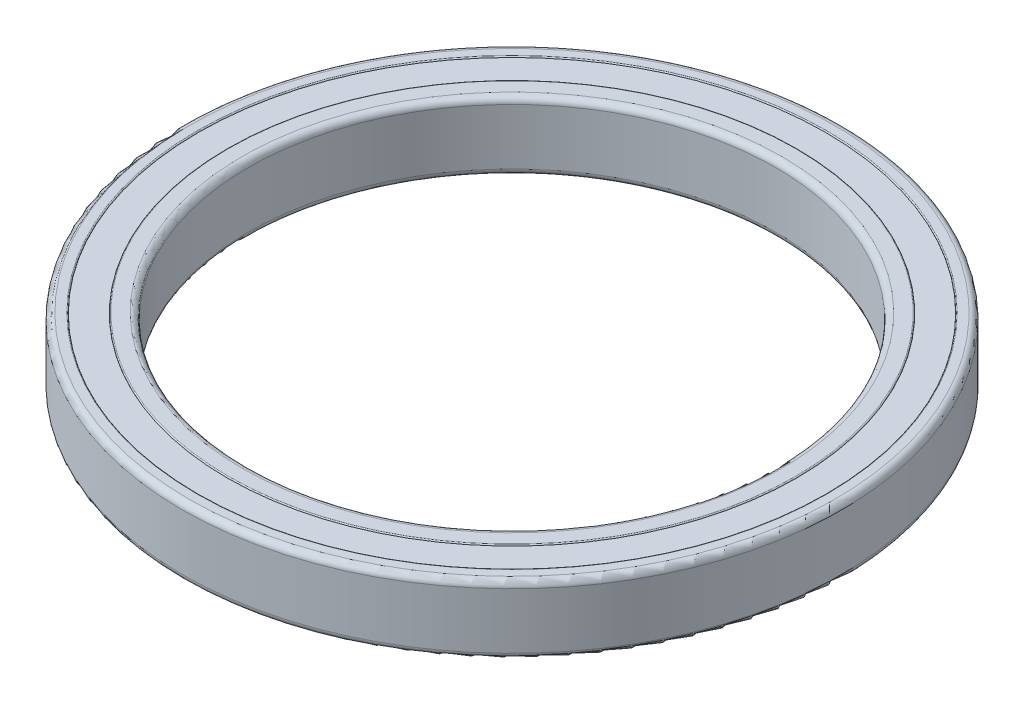
ISO-10303-21;
HEADER;
FILE_DESCRIPTION(('STEP AP214'),'2;1');
FILE_NAME('part.step','',(''),(''),'','','');
FILE_SCHEMA(('AUTOMOTIVE_DESIGN { 1 0 10303 214 1 1 1 1 }'));
ENDSEC;
DATA;
#1=APPLICATION_CONTEXT('core data for automotive mechanical design processes');
#2=APPLICATION_PROTOCOL_DEFINITION('international standard','automotive_design',2000,#1);
#3=PRODUCT_CONTEXT('',#1,'mechanical');
#4=PRODUCT('Part','Part','',(#3));
#5=PRODUCT_RELATED_PRODUCT_CATEGORY('part','',(#4));
#6=PRODUCT_DEFINITION_FORMATION('','',#4);
#7=PRODUCT_DEFINITION_CONTEXT('part definition',#1,'design');
#8=PRODUCT_DEFINITION('design','',#6,#7);
#9=PRODUCT_DEFINITION_SHAPE('','',#8);
#10=(LENGTH_UNIT() NAMED_UNIT(*) SI_UNIT(.MILLI.,.METRE.));
#11=(NAMED_UNIT(*) PLANE_ANGLE_UNIT() SI_UNIT($,.RADIAN.));
#12=(NAMED_UNIT(*) SI_UNIT($,.STERADIAN.) SOLID_ANGLE_UNIT());
#13=UNCERTAINTY_MEASURE_WITH_UNIT(LENGTH_MEASURE(1.E-05),#10,'distance_accuracy_value','');
#14=(GEOMETRIC_REPRESENTATION_CONTEXT(3) GLOBAL_UNCERTAINTY_ASSIGNED_CONTEXT((#13)) GLOBAL_UNIT_ASSIGNED_CONTEXT((#10,
#11,#12)) REPRESENTATION_CONTEXT('',''));
#15=CARTESIAN_POINT('',(0.,0.,0.));
#16=DIRECTION('',(0.,0.,1.));
#17=DIRECTION('',(1.,0.,0.));
#18=AXIS2_PLACEMENT_3D('',#15,#16,#17);
#19=CARTESIAN_POINT('',(0.,6.3,0.));
#20=DIRECTION('',(0.,1.,0.));
#21=DIRECTION('',(0.,0.,1.));
#22=AXIS2_PLACEMENT_3D('',#19,#20,#21);
#23=PLANE('',#22);
#24=CARTESIAN_POINT('',(0.,6.3,0.));
#25=DIRECTION('',(0.,1.,0.));
#26=DIRECTION('',(0.,0.,1.));
#27=AXIS2_PLACEMENT_3D('',#24,#25,#26);
#28=CIRCLE('',#27,59.5);
#29=CARTESIAN_POINT('',(0.,6.3,59.5));
#30=VERTEX_POINT('',#29);
#31=EDGE_CURVE('E11',#30,#30,#28,.T.);
#32=ORIENTED_EDGE('',*,*,#31,.T.);
#33=EDGE_LOOP('',(#32));
#34=FACE_BOUND('',#33,.T.);
#35=CARTESIAN_POINT('',(0.,6.3,0.));
#36=DIRECTION('',(0.,1.,0.));
#37=DIRECTION('',(0.,0.,1.));
#38=AXIS2_PLACEMENT_3D('',#35,#36,#37);
#39=CIRCLE('',#38,54.);
#40=CARTESIAN_POINT('',(0.,6.3,54.));
#41=VERTEX_POINT('',#40);
#42=EDGE_CURVE('E54',#41,#41,#39,.T.);
#43=ORIENTED_EDGE('',*,*,#42,.F.);
#44=EDGE_LOOP('',(#43));
#45=FACE_BOUND('',#44,.T.);
#46=ADVANCED_FACE('F43',(#34,#45),#23,.T.);
#47=CARTESIAN_POINT('',(0.,-6.3,0.));
#48=DIRECTION('',(0.,1.,0.));
#49=DIRECTION('',(0.,0.,1.));
#50=AXIS2_PLACEMENT_3D('',#47,#48,#49);
#51=PLANE('',#50);
#52=CARTESIAN_POINT('',(0.,-6.3,0.));
#53=DIRECTION('',(0.,1.,0.));
#54=DIRECTION('',(0.,0.,1.));
#55=AXIS2_PLACEMENT_3D('',#52,#53,#54);
#56=CIRCLE('',#55,59.5);
#57=CARTESIAN_POINT('',(0.,-6.3,59.5));
#58=VERTEX_POINT('',#57);
#59=EDGE_CURVE('E47',#58,#58,#56,.T.);
#60=ORIENTED_EDGE('',*,*,#59,.F.);
#61=EDGE_LOOP('',(#60));
#62=FACE_BOUND('',#61,.T.);
#63=CARTESIAN_POINT('',(0.,-6.3,0.));
#64=DIRECTION('',(0.,1.,0.));
#65=DIRECTION('',(0.,0.,1.));
#66=AXIS2_PLACEMENT_3D('',#63,#64,#65);
#67=CIRCLE('',#66,54.);
#68=CARTESIAN_POINT('',(0.,-6.3,54.));
#69=VERTEX_POINT('',#68);
#70=EDGE_CURVE('E56',#69,#69,#67,.T.);
#71=ORIENTED_EDGE('',*,*,#70,.T.);
#72=EDGE_LOOP('',(#71));
#73=FACE_BOUND('',#72,.T.);
#74=ADVANCED_FACE('F66',(#62,#73),#51,.F.);
#75=CARTESIAN_POINT('',(0.,6.3,0.));
#76=DIRECTION('',(0.,-1.,0.));
#77=DIRECTION('',(0.,0.,-1.));
#78=AXIS2_PLACEMENT_3D('',#75,#76,#77);
#79=CYLINDRICAL_SURFACE('',#78,59.5);
#80=ORIENTED_EDGE('',*,*,#31,.F.);
#81=EDGE_LOOP('',(#80));
#82=FACE_BOUND('',#81,.T.);
#83=ORIENTED_EDGE('',*,*,#59,.T.);
#84=EDGE_LOOP('',(#83));
#85=FACE_BOUND('',#84,.T.);
#86=ADVANCED_FACE('F45',(#82,#85),#79,.T.);
#87=CARTESIAN_POINT('',(0.,6.3,0.));
#88=DIRECTION('',(0.,-1.,0.));
#89=DIRECTION('',(0.,0.,-1.));
#90=AXIS2_PLACEMENT_3D('',#87,#88,#89);
#91=CYLINDRICAL_SURFACE('',#90,54.);
#92=ORIENTED_EDGE('',*,*,#42,.T.);
#93=EDGE_LOOP('',(#92));
#94=FACE_BOUND('',#93,.T.);
#95=ORIENTED_EDGE('',*,*,#70,.F.);
#96=EDGE_LOOP('',(#95));
#97=FACE_BOUND('',#96,.T.);
#98=ADVANCED_FACE('F62',(#94,#97),#91,.F.);
#99=CLOSED_SHELL('',(#46,#74,#86,#98));
#100=MANIFOLD_SOLID_BREP('B2',#99);
#101=CARTESIAN_POINT('',(0.,6.5,0.));
#102=DIRECTION('',(0.,1.,0.));
#103=DIRECTION('',(0.,0.,1.));
#104=AXIS2_PLACEMENT_3D('',#101,#102,#103);
#105=PLANE('',#104);
#106=CARTESIAN_POINT('',(0.,6.5,0.));
#107=DIRECTION('',(0.,1.,0.));
#108=DIRECTION('',(0.,0.,1.));
#109=AXIS2_PLACEMENT_3D('',#106,#107,#108);
#110=CIRCLE('',#109,53.8);
#111=CARTESIAN_POINT('',(0.,6.5,53.8));
#112=VERTEX_POINT('',#111);
#113=EDGE_CURVE('E42',#112,#112,#110,.T.);
#114=ORIENTED_EDGE('',*,*,#113,.T.);
#115=EDGE_LOOP('',(#114));
#116=FACE_BOUND('',#115,.T.);
#117=CARTESIAN_POINT('',(0.,6.5,0.));
#118=DIRECTION('',(0.,1.,0.));
#119=DIRECTION('',(0.,0.,1.));
#120=AXIS2_PLACEMENT_3D('',#117,#118,#119);
#121=CIRCLE('',#120,51.2);
#122=CARTESIAN_POINT('',(0.,6.5,51.2));
#123=VERTEX_POINT('',#122);
#124=EDGE_CURVE('E131',#123,#123,#121,.F.);
#125=ORIENTED_EDGE('',*,*,#124,.T.);
#126=EDGE_LOOP('',(#125));
#127=FACE_BOUND('',#126,.T.);
#128=ADVANCED_FACE('F111',(#116,#127),#105,.T.);
#129=CARTESIAN_POINT('',(0.,-6.5,0.));
#130=DIRECTION('',(0.,1.,0.));
#131=DIRECTION('',(0.,0.,1.));
#132=AXIS2_PLACEMENT_3D('',#129,#130,#131);
#133=PLANE('',#132);
#134=CARTESIAN_POINT('',(0.,-6.5,0.));
#135=DIRECTION('',(0.,1.,0.));
#136=DIRECTION('',(0.,0.,1.));
#137=AXIS2_PLACEMENT_3D('',#134,#135,#136);
#138=CIRCLE('',#137,53.8);
#139=CARTESIAN_POINT('',(0.,-6.5,53.8));
#140=VERTEX_POINT('',#139);
#141=EDGE_CURVE('E118',#140,#140,#138,.F.);
#142=ORIENTED_EDGE('',*,*,#141,.T.);
#143=EDGE_LOOP('',(#142));
#144=FACE_BOUND('',#143,.T.);
#145=CARTESIAN_POINT('',(0.,-6.5,0.));
#146=DIRECTION('',(0.,1.,0.));
#147=DIRECTION('',(0.,0.,1.));
#148=AXIS2_PLACEMENT_3D('',#145,#146,#147);
#149=CIRCLE('',#148,51.2);
#150=CARTESIAN_POINT('',(0.,-6.5,51.2));
#151=VERTEX_POINT('',#150);
#152=EDGE_CURVE('E140',#151,#151,#149,.T.);
#153=ORIENTED_EDGE('',*,*,#152,.T.);
#154=EDGE_LOOP('',(#153));
#155=FACE_BOUND('',#154,.T.);
#156=ADVANCED_FACE('F144',(#144,#155),#133,.F.);
#157=CARTESIAN_POINT('',(0.,6.5,0.));
#158=DIRECTION('',(0.,-1.,0.));
#159=DIRECTION('',(0.,0.,-1.));
#160=AXIS2_PLACEMENT_3D('',#157,#158,#159);
#161=CYLINDRICAL_SURFACE('',#160,54.);
#162=CARTESIAN_POINT('',(0.,-6.3,0.));
#163=DIRECTION('',(0.,1.,0.));
#164=DIRECTION('',(0.,0.,1.));
#165=AXIS2_PLACEMENT_3D('',#162,#163,#164);
#166=CIRCLE('',#165,54.);
#167=CARTESIAN_POINT('',(0.,-6.3,54.));
#168=VERTEX_POINT('',#167);
#169=EDGE_CURVE('E122',#168,#168,#166,.T.);
#170=ORIENTED_EDGE('',*,*,#169,.T.);
#171=EDGE_LOOP('',(#170));
#172=FACE_BOUND('',#171,.T.);
#173=CARTESIAN_POINT('',(0.,6.3,0.));
#174=DIRECTION('',(0.,1.,0.));
#175=DIRECTION('',(0.,0.,1.));
#176=AXIS2_PLACEMENT_3D('',#173,#174,#175);
#177=CIRCLE('',#176,54.);
#178=CARTESIAN_POINT('',(0.,6.3,54.));
#179=VERTEX_POINT('',#178);
#180=EDGE_CURVE('E126',#179,#179,#177,.F.);
#181=ORIENTED_EDGE('',*,*,#180,.T.);
#182=EDGE_LOOP('',(#181));
#183=FACE_BOUND('',#182,.T.);
#184=ADVANCED_FACE('F159',(#172,#183),#161,.T.);
#185=CARTESIAN_POINT('',(0.,6.5,0.));
#186=DIRECTION('',(0.,-1.,0.));
#187=DIRECTION('',(0.,0.,-1.));
#188=AXIS2_PLACEMENT_3D('',#185,#186,#187);
#189=CYLINDRICAL_SURFACE('',#188,50.);
#190=CARTESIAN_POINT('',(0.,-5.3,0.));
#191=DIRECTION('',(0.,1.,0.));
#192=DIRECTION('',(0.,0.,1.));
#193=AXIS2_PLACEMENT_3D('',#190,#191,#192);
#194=CIRCLE('',#193,50.);
#195=CARTESIAN_POINT('',(0.,-5.3,50.));
#196=VERTEX_POINT('',#195);
#197=EDGE_CURVE('E134',#196,#196,#194,.F.);
#198=ORIENTED_EDGE('',*,*,#197,.T.);
#199=EDGE_LOOP('',(#198));
#200=FACE_BOUND('',#199,.T.);
#201=CARTESIAN_POINT('',(0.,5.3,0.));
#202=DIRECTION('',(0.,1.,0.));
#203=DIRECTION('',(0.,0.,1.));
#204=AXIS2_PLACEMENT_3D('',#201,#202,#203);
#205=CIRCLE('',#204,50.);
#206=CARTESIAN_POINT('',(0.,5.3,50.));
#207=VERTEX_POINT('',#206);
#208=EDGE_CURVE('E137',#207,#207,#205,.T.);
#209=ORIENTED_EDGE('',*,*,#208,.T.);
#210=EDGE_LOOP('',(#209));
#211=FACE_BOUND('',#210,.T.);
#212=ADVANCED_FACE('F149',(#200,#211),#189,.F.);
#213=CARTESIAN_POINT('',(0.,-5.3,0.));
#214=DIRECTION('',(0.,1.,0.));
#215=DIRECTION('',(0.,0.,1.));
#216=AXIS2_PLACEMENT_3D('',#213,#214,#215);
#217=TOROIDAL_SURFACE('',#216,51.2,1.2);
#218=ORIENTED_EDGE('',*,*,#197,.F.);
#219=EDGE_LOOP('',(#218));
#220=FACE_BOUND('',#219,.T.);
#221=ORIENTED_EDGE('',*,*,#152,.F.);
#222=EDGE_LOOP('',(#221));
#223=FACE_BOUND('',#222,.T.);
#224=ADVANCED_FACE('F146',(#220,#223),#217,.T.);
#225=CARTESIAN_POINT('',(0.,5.3,0.));
#226=DIRECTION('',(0.,1.,0.));
#227=DIRECTION('',(0.,0.,1.));
#228=AXIS2_PLACEMENT_3D('',#225,#226,#227);
#229=TOROIDAL_SURFACE('',#228,51.2,1.2);
#230=ORIENTED_EDGE('',*,*,#124,.F.);
#231=EDGE_LOOP('',(#230));
#232=FACE_BOUND('',#231,.T.);
#233=ORIENTED_EDGE('',*,*,#208,.F.);
#234=EDGE_LOOP('',(#233));
#235=FACE_BOUND('',#234,.T.);
#236=ADVANCED_FACE('F148',(#232,#235),#229,.T.);
#237=CARTESIAN_POINT('',(0.,-6.3,0.));
#238=DIRECTION('',(0.,1.,0.));
#239=DIRECTION('',(0.,0.,1.));
#240=AXIS2_PLACEMENT_3D('',#237,#238,#239);
#241=TOROIDAL_SURFACE('',#240,53.8,0.2);
#242=ORIENTED_EDGE('',*,*,#141,.F.);
#243=EDGE_LOOP('',(#242));
#244=FACE_BOUND('',#243,.T.);
#245=ORIENTED_EDGE('',*,*,#169,.F.);
#246=EDGE_LOOP('',(#245));
#247=FACE_BOUND('',#246,.T.);
#248=ADVANCED_FACE('F156',(#244,#247),#241,.T.);
#249=CARTESIAN_POINT('',(0.,6.3,0.));
#250=DIRECTION('',(0.,1.,0.));
#251=DIRECTION('',(0.,0.,1.));
#252=AXIS2_PLACEMENT_3D('',#249,#250,#251);
#253=TOROIDAL_SURFACE('',#252,53.8,0.2);
#254=ORIENTED_EDGE('',*,*,#180,.F.);
#255=EDGE_LOOP('',(#254));
#256=FACE_BOUND('',#255,.T.);
#257=ORIENTED_EDGE('',*,*,#113,.F.);
#258=EDGE_LOOP('',(#257));
#259=FACE_BOUND('',#258,.T.);
#260=ADVANCED_FACE('F113',(#256,#259),#253,.T.);
#261=CLOSED_SHELL('',(#128,#156,#184,#212,#224,#236,#248,#260));
#262=MANIFOLD_SOLID_BREP('B6',#261);
#263=CARTESIAN_POINT('',(0.,6.5,0.));
#264=DIRECTION('',(0.,1.,0.));
#265=DIRECTION('',(0.,0.,1.));
#266=AXIS2_PLACEMENT_3D('',#263,#264,#265);
#267=PLANE('',#266);
#268=CARTESIAN_POINT('',(0.,6.5,0.));
#269=DIRECTION('',(0.,1.,0.));
#270=DIRECTION('',(0.,0.,1.));
#271=AXIS2_PLACEMENT_3D('',#268,#269,#270);
#272=CIRCLE('',#271,59.7);
#273=CARTESIAN_POINT('',(0.,6.5,59.7));
#274=VERTEX_POINT('',#273);
#275=EDGE_CURVE('E239',#274,#274,#272,.F.);
#276=ORIENTED_EDGE('',*,*,#275,.T.);
#277=EDGE_LOOP('',(#276));
#278=FACE_BOUND('',#277,.T.);
#279=CARTESIAN_POINT('',(0.,6.5,0.));
#280=DIRECTION('',(0.,1.,0.));
#281=DIRECTION('',(0.,0.,1.));
#282=AXIS2_PLACEMENT_3D('',#279,#280,#281);
#283=CIRCLE('',#282,61.3);
#284=CARTESIAN_POINT('',(0.,6.5,61.3));
#285=VERTEX_POINT('',#284);
#286=EDGE_CURVE('E252',#285,#285,#283,.T.);
#287=ORIENTED_EDGE('',*,*,#286,.T.);
#288=EDGE_LOOP('',(#287));
#289=FACE_BOUND('',#288,.T.);
#290=ADVANCED_FACE('F232',(#278,#289),#267,.T.);
#291=CARTESIAN_POINT('',(0.,-6.5,0.));
#292=DIRECTION('',(0.,1.,0.));
#293=DIRECTION('',(0.,0.,1.));
#294=AXIS2_PLACEMENT_3D('',#291,#292,#293);
#295=PLANE('',#294);
#296=CARTESIAN_POINT('',(0.,-6.5,0.));
#297=DIRECTION('',(0.,1.,0.));
#298=DIRECTION('',(0.,0.,1.));
#299=AXIS2_PLACEMENT_3D('',#296,#297,#298);
#300=CIRCLE('',#299,59.7);
#301=CARTESIAN_POINT('',(0.,-6.5,59.7));
#302=VERTEX_POINT('',#301);
#303=EDGE_CURVE('E110',#302,#302,#300,.T.);
#304=ORIENTED_EDGE('',*,*,#303,.T.);
#305=EDGE_LOOP('',(#304));
#306=FACE_BOUND('',#305,.T.);
#307=CARTESIAN_POINT('',(0.,-6.5,0.));
#308=DIRECTION('',(0.,1.,0.));
#309=DIRECTION('',(0.,0.,1.));
#310=AXIS2_PLACEMENT_3D('',#307,#308,#309);
#311=CIRCLE('',#310,61.3);
#312=CARTESIAN_POINT('',(0.,-6.5,61.3));
#313=VERTEX_POINT('',#312);
#314=EDGE_CURVE('E255',#313,#313,#311,.F.);
#315=ORIENTED_EDGE('',*,*,#314,.T.);
#316=EDGE_LOOP('',(#315));
#317=FACE_BOUND('',#316,.T.);
#318=ADVANCED_FACE('F276',(#306,#317),#295,.F.);
#319=CARTESIAN_POINT('',(0.,6.5,0.));
#320=DIRECTION('',(0.,-1.,0.));
#321=DIRECTION('',(0.,0.,-1.));
#322=AXIS2_PLACEMENT_3D('',#319,#320,#321);
#323=CYLINDRICAL_SURFACE('',#322,62.5);
#324=CARTESIAN_POINT('',(0.,-5.3,0.));
#325=DIRECTION('',(0.,1.,0.));
#326=DIRECTION('',(0.,0.,1.));
#327=AXIS2_PLACEMENT_3D('',#324,#325,#326);
#328=CIRCLE('',#327,62.5);
#329=CARTESIAN_POINT('',(0.,-5.3,62.5));
#330=VERTEX_POINT('',#329);
#331=EDGE_CURVE('E258',#330,#330,#328,.T.);
#332=ORIENTED_EDGE('',*,*,#331,.T.);
#333=EDGE_LOOP('',(#332));
#334=FACE_BOUND('',#333,.T.);
#335=CARTESIAN_POINT('',(0.,5.3,0.));
#336=DIRECTION('',(0.,1.,0.));
#337=DIRECTION('',(0.,0.,1.));
#338=AXIS2_PLACEMENT_3D('',#335,#336,#337);
#339=CIRCLE('',#338,62.5);
#340=CARTESIAN_POINT('',(0.,5.3,62.5));
#341=VERTEX_POINT('',#340);
#342=EDGE_CURVE('E261',#341,#341,#339,.F.);
#343=ORIENTED_EDGE('',*,*,#342,.T.);
#344=EDGE_LOOP('',(#343));
#345=FACE_BOUND('',#344,.T.);
#346=ADVANCED_FACE('F265',(#334,#345),#323,.T.);
#347=CARTESIAN_POINT('',(0.,6.5,0.));
#348=DIRECTION('',(0.,-1.,0.));
#349=DIRECTION('',(0.,0.,-1.));
#350=AXIS2_PLACEMENT_3D('',#347,#348,#349);
#351=CYLINDRICAL_SURFACE('',#350,59.5);
#352=CARTESIAN_POINT('',(0.,6.3,0.));
#353=DIRECTION('',(0.,1.,0.));
#354=DIRECTION('',(0.,0.,1.));
#355=AXIS2_PLACEMENT_3D('',#352,#353,#354);
#356=CIRCLE('',#355,59.5);
#357=CARTESIAN_POINT('',(0.,6.3,59.5));
#358=VERTEX_POINT('',#357);
#359=EDGE_CURVE('E243',#358,#358,#356,.T.);
#360=ORIENTED_EDGE('',*,*,#359,.T.);
#361=EDGE_LOOP('',(#360));
#362=FACE_BOUND('',#361,.T.);
#363=CARTESIAN_POINT('',(0.,-6.3,0.));
#364=DIRECTION('',(0.,1.,0.));
#365=DIRECTION('',(0.,0.,1.));
#366=AXIS2_PLACEMENT_3D('',#363,#364,#365);
#367=CIRCLE('',#366,59.5);
#368=CARTESIAN_POINT('',(0.,-6.3,59.5));
#369=VERTEX_POINT('',#368);
#370=EDGE_CURVE('E247',#369,#369,#367,.F.);
#371=ORIENTED_EDGE('',*,*,#370,.T.);
#372=EDGE_LOOP('',(#371));
#373=FACE_BOUND('',#372,.T.);
#374=ADVANCED_FACE('F283',(#362,#373),#351,.F.);
#375=CARTESIAN_POINT('',(0.,-5.3,0.));
#376=DIRECTION('',(0.,1.,0.));
#377=DIRECTION('',(0.,0.,1.));
#378=AXIS2_PLACEMENT_3D('',#375,#376,#377);
#379=TOROIDAL_SURFACE('',#378,61.3,1.2);
#380=ORIENTED_EDGE('',*,*,#314,.F.);
#381=EDGE_LOOP('',(#380));
#382=FACE_BOUND('',#381,.T.);
#383=ORIENTED_EDGE('',*,*,#331,.F.);
#384=EDGE_LOOP('',(#383));
#385=FACE_BOUND('',#384,.T.);
#386=ADVANCED_FACE('F271',(#382,#385),#379,.T.);
#387=CARTESIAN_POINT('',(0.,5.3,0.));
#388=DIRECTION('',(0.,1.,0.));
#389=DIRECTION('',(0.,0.,1.));
#390=AXIS2_PLACEMENT_3D('',#387,#388,#389);
#391=TOROIDAL_SURFACE('',#390,61.3,1.2);
#392=ORIENTED_EDGE('',*,*,#342,.F.);
#393=EDGE_LOOP('',(#392));
#394=FACE_BOUND('',#393,.T.);
#395=ORIENTED_EDGE('',*,*,#286,.F.);
#396=EDGE_LOOP('',(#395));
#397=FACE_BOUND('',#396,.T.);
#398=ADVANCED_FACE('F267',(#394,#397),#391,.T.);
#399=CARTESIAN_POINT('',(0.,6.3,0.));
#400=DIRECTION('',(0.,1.,0.));
#401=DIRECTION('',(0.,0.,1.));
#402=AXIS2_PLACEMENT_3D('',#399,#400,#401);
#403=TOROIDAL_SURFACE('',#402,59.7,0.2);
#404=ORIENTED_EDGE('',*,*,#275,.F.);
#405=EDGE_LOOP('',(#404));
#406=FACE_BOUND('',#405,.T.);
#407=ORIENTED_EDGE('',*,*,#359,.F.);
#408=EDGE_LOOP('',(#407));
#409=FACE_BOUND('',#408,.T.);
#410=ADVANCED_FACE('F270',(#406,#409),#403,.T.);
#411=CARTESIAN_POINT('',(0.,-6.3,0.));
#412=DIRECTION('',(0.,1.,0.));
#413=DIRECTION('',(0.,0.,1.));
#414=AXIS2_PLACEMENT_3D('',#411,#412,#413);
#415=TOROIDAL_SURFACE('',#414,59.7,0.2);
#416=ORIENTED_EDGE('',*,*,#370,.F.);
#417=EDGE_LOOP('',(#416));
#418=FACE_BOUND('',#417,.T.);
#419=ORIENTED_EDGE('',*,*,#303,.F.);
#420=EDGE_LOOP('',(#419));
#421=FACE_BOUND('',#420,.T.);
#422=ADVANCED_FACE('F234',(#418,#421),#415,.T.);
#423=CLOSED_SHELL('',(#290,#318,#346,#374,#386,#398,#410,#422));
#424=MANIFOLD_SOLID_BREP('B37',#423);
#425=ADVANCED_BREP_SHAPE_REPRESENTATION('',(#18,#100,#262,#424),#14);
#426=SHAPE_DEFINITION_REPRESENTATION(#9,#425);
ENDSEC;
END-ISO-10303-21;
